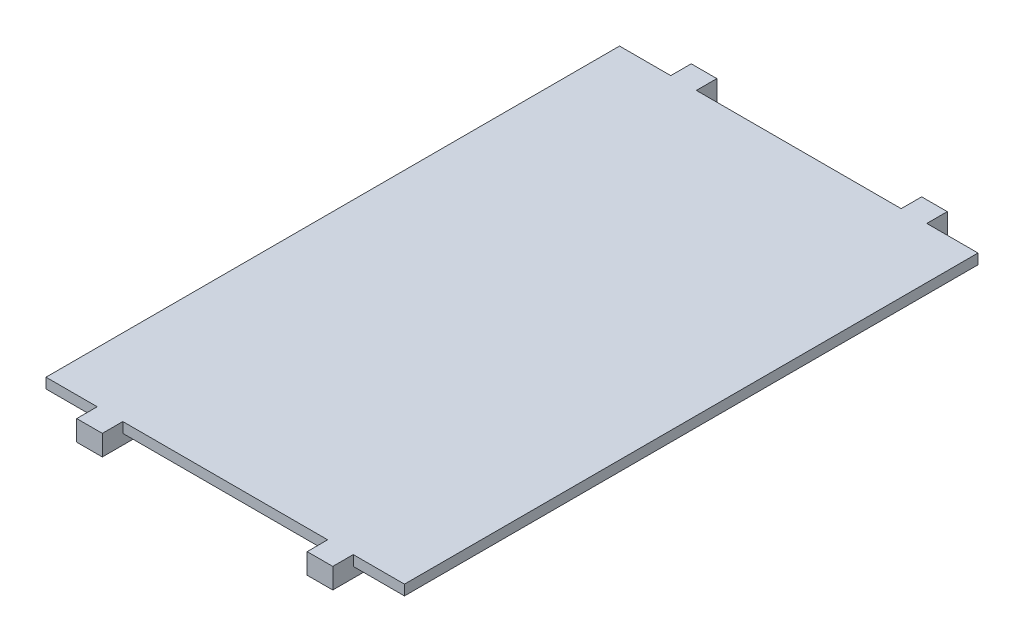
ISO-10303-21;
HEADER;
FILE_DESCRIPTION(('STEP AP214'),'2;1');
FILE_NAME('part.step','',(''),(''),'','','');
FILE_SCHEMA(('AUTOMOTIVE_DESIGN { 1 0 10303 214 1 1 1 1 }'));
ENDSEC;
DATA;
#1=APPLICATION_CONTEXT('core data for automotive mechanical design processes');
#2=APPLICATION_PROTOCOL_DEFINITION('international standard','automotive_design',2000,#1);
#3=PRODUCT_CONTEXT('',#1,'mechanical');
#4=PRODUCT('Part','Part','',(#3));
#5=PRODUCT_RELATED_PRODUCT_CATEGORY('part','',(#4));
#6=PRODUCT_DEFINITION_FORMATION('','',#4);
#7=PRODUCT_DEFINITION_CONTEXT('part definition',#1,'design');
#8=PRODUCT_DEFINITION('design','',#6,#7);
#9=PRODUCT_DEFINITION_SHAPE('','',#8);
#10=(LENGTH_UNIT() NAMED_UNIT(*) SI_UNIT(.MILLI.,.METRE.));
#11=(NAMED_UNIT(*) PLANE_ANGLE_UNIT() SI_UNIT($,.RADIAN.));
#12=(NAMED_UNIT(*) SI_UNIT($,.STERADIAN.) SOLID_ANGLE_UNIT());
#13=UNCERTAINTY_MEASURE_WITH_UNIT(LENGTH_MEASURE(1.E-05),#10,'distance_accuracy_value','');
#14=(GEOMETRIC_REPRESENTATION_CONTEXT(3) GLOBAL_UNCERTAINTY_ASSIGNED_CONTEXT((#13)) GLOBAL_UNIT_ASSIGNED_CONTEXT((#10,
#11,#12)) REPRESENTATION_CONTEXT('',''));
#15=CARTESIAN_POINT('',(0.,0.,0.));
#16=DIRECTION('',(0.,0.,1.));
#17=DIRECTION('',(1.,0.,0.));
#18=AXIS2_PLACEMENT_3D('',#15,#16,#17);
#19=CARTESIAN_POINT('',(0.,0.,0.));
#20=DIRECTION('',(0.,1.,0.));
#21=DIRECTION('',(0.,0.,1.));
#22=AXIS2_PLACEMENT_3D('',#19,#20,#21);
#23=PLANE('',#22);
#24=DIRECTION('',(1.,0.,0.));
#25=VECTOR('',#24,1.);
#26=CARTESIAN_POINT('',(0.,0.,3.));
#27=LINE('',#26,#25);
#28=CARTESIAN_POINT('',(-1.25,0.,3.));
#29=VERTEX_POINT('',#28);
#30=CARTESIAN_POINT('',(-1.,0.,3.));
#31=VERTEX_POINT('',#30);
#32=EDGE_CURVE('E278',#29,#31,#27,.T.);
#33=ORIENTED_EDGE('',*,*,#32,.F.);
#34=DIRECTION('',(0.,0.,1.));
#35=VECTOR('',#34,1.);
#36=CARTESIAN_POINT('',(-1.25,0.,0.));
#37=LINE('',#36,#35);
#38=CARTESIAN_POINT('',(-1.25,0.,2.7));
#39=VERTEX_POINT('',#38);
#40=EDGE_CURVE('E276',#39,#29,#37,.T.);
#41=ORIENTED_EDGE('',*,*,#40,.F.);
#42=DIRECTION('',(1.,0.,0.));
#43=VECTOR('',#42,1.);
#44=CARTESIAN_POINT('',(0.,0.,2.7));
#45=LINE('',#44,#43);
#46=CARTESIAN_POINT('',(-1.65,0.,2.7));
#47=VERTEX_POINT('',#46);
#48=EDGE_CURVE('E274',#47,#39,#45,.T.);
#49=ORIENTED_EDGE('',*,*,#48,.F.);
#50=DIRECTION('',(0.,0.,1.));
#51=VECTOR('',#50,1.);
#52=CARTESIAN_POINT('',(-1.65,0.,-2.7));
#53=LINE('',#52,#51);
#54=CARTESIAN_POINT('',(-1.65,0.,-2.45));
#55=VERTEX_POINT('',#54);
#56=EDGE_CURVE('E299',#55,#47,#53,.T.);
#57=ORIENTED_EDGE('',*,*,#56,.F.);
#58=DIRECTION('',(-0.707106781186548,0.,0.707106781186548));
#59=VECTOR('',#58,1.);
#60=CARTESIAN_POINT('',(-1.525,0.,-2.575));
#61=LINE('',#60,#59);
#62=CARTESIAN_POINT('',(-1.4,0.,-2.7));
#63=VERTEX_POINT('',#62);
#64=EDGE_CURVE('E304',#63,#55,#61,.T.);
#65=ORIENTED_EDGE('',*,*,#64,.F.);
#66=DIRECTION('',(1.,0.,0.));
#67=VECTOR('',#66,1.);
#68=CARTESIAN_POINT('',(0.,0.,-2.7));
#69=LINE('',#68,#67);
#70=CARTESIAN_POINT('',(-1.25,0.,-2.7));
#71=VERTEX_POINT('',#70);
#72=EDGE_CURVE('E272',#71,#63,#69,.F.);
#73=ORIENTED_EDGE('',*,*,#72,.F.);
#74=DIRECTION('',(0.,0.,1.));
#75=VECTOR('',#74,1.);
#76=CARTESIAN_POINT('',(-1.25,0.,0.));
#77=LINE('',#76,#75);
#78=CARTESIAN_POINT('',(-1.25,0.,-3.));
#79=VERTEX_POINT('',#78);
#80=EDGE_CURVE('E270',#79,#71,#77,.T.);
#81=ORIENTED_EDGE('',*,*,#80,.F.);
#82=DIRECTION('',(1.,0.,0.));
#83=VECTOR('',#82,1.);
#84=CARTESIAN_POINT('',(0.,0.,-3.));
#85=LINE('',#84,#83);
#86=CARTESIAN_POINT('',(-1.,0.,-3.));
#87=VERTEX_POINT('',#86);
#88=EDGE_CURVE('E268',#87,#79,#85,.F.);
#89=ORIENTED_EDGE('',*,*,#88,.F.);
#90=DIRECTION('',(0.,0.,1.));
#91=VECTOR('',#90,1.);
#92=CARTESIAN_POINT('',(-1.,0.,0.));
#93=LINE('',#92,#91);
#94=CARTESIAN_POINT('',(-1.,0.,-2.7));
#95=VERTEX_POINT('',#94);
#96=EDGE_CURVE('E266',#95,#87,#93,.F.);
#97=ORIENTED_EDGE('',*,*,#96,.F.);
#98=DIRECTION('',(-1.,0.,0.));
#99=VECTOR('',#98,1.);
#100=CARTESIAN_POINT('',(1.65,0.,-2.7));
#101=LINE('',#100,#99);
#102=CARTESIAN_POINT('',(1.,0.,-2.7));
#103=VERTEX_POINT('',#102);
#104=EDGE_CURVE('E290',#103,#95,#101,.T.);
#105=ORIENTED_EDGE('',*,*,#104,.F.);
#106=DIRECTION('',(0.,0.,1.));
#107=VECTOR('',#106,1.);
#108=CARTESIAN_POINT('',(1.,0.,0.));
#109=LINE('',#108,#107);
#110=CARTESIAN_POINT('',(1.,0.,-3.));
#111=VERTEX_POINT('',#110);
#112=EDGE_CURVE('E264',#111,#103,#109,.T.);
#113=ORIENTED_EDGE('',*,*,#112,.F.);
#114=DIRECTION('',(1.,0.,0.));
#115=VECTOR('',#114,1.);
#116=CARTESIAN_POINT('',(0.,0.,-3.));
#117=LINE('',#116,#115);
#118=CARTESIAN_POINT('',(1.25,0.,-3.));
#119=VERTEX_POINT('',#118);
#120=EDGE_CURVE('E262',#119,#111,#117,.F.);
#121=ORIENTED_EDGE('',*,*,#120,.F.);
#122=DIRECTION('',(0.,0.,1.));
#123=VECTOR('',#122,1.);
#124=CARTESIAN_POINT('',(1.25,0.,0.));
#125=LINE('',#124,#123);
#126=CARTESIAN_POINT('',(1.25,0.,-2.7));
#127=VERTEX_POINT('',#126);
#128=EDGE_CURVE('E260',#127,#119,#125,.F.);
#129=ORIENTED_EDGE('',*,*,#128,.F.);
#130=DIRECTION('',(1.,0.,0.));
#131=VECTOR('',#130,1.);
#132=CARTESIAN_POINT('',(0.,0.,-2.7));
#133=LINE('',#132,#131);
#134=CARTESIAN_POINT('',(1.65,0.,-2.7));
#135=VERTEX_POINT('',#134);
#136=EDGE_CURVE('E258',#135,#127,#133,.F.);
#137=ORIENTED_EDGE('',*,*,#136,.F.);
#138=DIRECTION('',(0.,0.,-1.));
#139=VECTOR('',#138,1.);
#140=CARTESIAN_POINT('',(1.65,0.,2.7));
#141=LINE('',#140,#139);
#142=CARTESIAN_POINT('',(1.65,0.,2.7));
#143=VERTEX_POINT('',#142);
#144=EDGE_CURVE('E285',#143,#135,#141,.T.);
#145=ORIENTED_EDGE('',*,*,#144,.F.);
#146=DIRECTION('',(1.,0.,0.));
#147=VECTOR('',#146,1.);
#148=CARTESIAN_POINT('',(0.,0.,2.7));
#149=LINE('',#148,#147);
#150=CARTESIAN_POINT('',(1.25,0.,2.7));
#151=VERTEX_POINT('',#150);
#152=EDGE_CURVE('E254',#151,#143,#149,.T.);
#153=ORIENTED_EDGE('',*,*,#152,.F.);
#154=DIRECTION('',(0.,0.,1.));
#155=VECTOR('',#154,1.);
#156=CARTESIAN_POINT('',(1.25,0.,0.));
#157=LINE('',#156,#155);
#158=CARTESIAN_POINT('',(1.25,0.,3.));
#159=VERTEX_POINT('',#158);
#160=EDGE_CURVE('E253',#159,#151,#157,.F.);
#161=ORIENTED_EDGE('',*,*,#160,.F.);
#162=DIRECTION('',(1.,0.,0.));
#163=VECTOR('',#162,1.);
#164=CARTESIAN_POINT('',(0.,0.,3.));
#165=LINE('',#164,#163);
#166=CARTESIAN_POINT('',(1.,0.,3.));
#167=VERTEX_POINT('',#166);
#168=EDGE_CURVE('E229',#167,#159,#165,.T.);
#169=ORIENTED_EDGE('',*,*,#168,.F.);
#170=DIRECTION('',(0.,0.,1.));
#171=VECTOR('',#170,1.);
#172=CARTESIAN_POINT('',(1.,0.,0.));
#173=LINE('',#172,#171);
#174=CARTESIAN_POINT('',(1.,0.,2.7));
#175=VERTEX_POINT('',#174);
#176=EDGE_CURVE('E20',#175,#167,#173,.T.);
#177=ORIENTED_EDGE('',*,*,#176,.F.);
#178=DIRECTION('',(1.,0.,0.));
#179=VECTOR('',#178,1.);
#180=CARTESIAN_POINT('',(-1.65,0.,2.7));
#181=LINE('',#180,#179);
#182=CARTESIAN_POINT('',(-1.,0.,2.7));
#183=VERTEX_POINT('',#182);
#184=EDGE_CURVE('E313',#183,#175,#181,.T.);
#185=ORIENTED_EDGE('',*,*,#184,.F.);
#186=DIRECTION('',(0.,0.,1.));
#187=VECTOR('',#186,1.);
#188=CARTESIAN_POINT('',(-1.,0.,0.));
#189=LINE('',#188,#187);
#190=EDGE_CURVE('E280',#31,#183,#189,.F.);
#191=ORIENTED_EDGE('',*,*,#190,.F.);
#192=EDGE_LOOP('',(#33,#41,#49,#57,#65,#73,#81,#89,#97,#105,#113,#121,#129,#137,#145,#153,#161,
#169,#177,#185,#191));
#193=FACE_BOUND('',#192,.T.);
#194=ADVANCED_FACE('F17',(#193),#23,.F.);
#195=CARTESIAN_POINT('',(1.65,0.,2.7));
#196=DIRECTION('',(1.,0.,0.));
#197=DIRECTION('',(0.,0.,-1.));
#198=AXIS2_PLACEMENT_3D('',#195,#196,#197);
#199=PLANE('',#198);
#200=DIRECTION('',(0.,1.,0.));
#201=VECTOR('',#200,1.);
#202=CARTESIAN_POINT('',(1.65,0.,-2.7));
#203=LINE('',#202,#201);
#204=CARTESIAN_POINT('',(1.65,0.1,-2.7));
#205=VERTEX_POINT('',#204);
#206=EDGE_CURVE('E288',#135,#205,#203,.T.);
#207=ORIENTED_EDGE('',*,*,#206,.T.);
#208=DIRECTION('',(0.,0.,1.));
#209=VECTOR('',#208,1.);
#210=CARTESIAN_POINT('',(1.65,0.1,0.));
#211=LINE('',#210,#209);
#212=CARTESIAN_POINT('',(1.65,0.1,2.7));
#213=VERTEX_POINT('',#212);
#214=EDGE_CURVE('E324',#205,#213,#211,.T.);
#215=ORIENTED_EDGE('',*,*,#214,.T.);
#216=DIRECTION('',(0.,1.,0.));
#217=VECTOR('',#216,1.);
#218=CARTESIAN_POINT('',(1.65,0.,2.7));
#219=LINE('',#218,#217);
#220=EDGE_CURVE('E282',#213,#143,#219,.F.);
#221=ORIENTED_EDGE('',*,*,#220,.T.);
#222=ORIENTED_EDGE('',*,*,#144,.T.);
#223=EDGE_LOOP('',(#207,#215,#221,#222));
#224=FACE_BOUND('',#223,.T.);
#225=ADVANCED_FACE('F502',(#224),#199,.T.);
#226=CARTESIAN_POINT('',(1.65,0.,-2.7));
#227=DIRECTION('',(0.,0.,-1.));
#228=DIRECTION('',(-1.,0.,0.));
#229=AXIS2_PLACEMENT_3D('',#226,#227,#228);
#230=PLANE('',#229);
#231=DIRECTION('',(1.,0.,0.));
#232=VECTOR('',#231,1.);
#233=CARTESIAN_POINT('',(0.,0.1,-2.7));
#234=LINE('',#233,#232);
#235=CARTESIAN_POINT('',(-1.,0.1,-2.7));
#236=VERTEX_POINT('',#235);
#237=CARTESIAN_POINT('',(1.,0.1,-2.7));
#238=VERTEX_POINT('',#237);
#239=EDGE_CURVE('E332',#236,#238,#234,.T.);
#240=ORIENTED_EDGE('',*,*,#239,.T.);
#241=DIRECTION('',(0.,1.,0.));
#242=VECTOR('',#241,1.);
#243=CARTESIAN_POINT('',(1.,0.,-2.7));
#244=LINE('',#243,#242);
#245=EDGE_CURVE('E296',#238,#103,#244,.F.);
#246=ORIENTED_EDGE('',*,*,#245,.T.);
#247=ORIENTED_EDGE('',*,*,#104,.T.);
#248=DIRECTION('',(0.,1.,0.));
#249=VECTOR('',#248,1.);
#250=CARTESIAN_POINT('',(-1.,0.,-2.7));
#251=LINE('',#250,#249);
#252=EDGE_CURVE('E293',#95,#236,#251,.T.);
#253=ORIENTED_EDGE('',*,*,#252,.T.);
#254=EDGE_LOOP('',(#240,#246,#247,#253));
#255=FACE_BOUND('',#254,.T.);
#256=ADVANCED_FACE('F850',(#255),#230,.T.);
#257=CARTESIAN_POINT('',(-1.65,0.,-2.7));
#258=DIRECTION('',(-1.,0.,0.));
#259=DIRECTION('',(0.,0.,1.));
#260=AXIS2_PLACEMENT_3D('',#257,#258,#259);
#261=PLANE('',#260);
#262=DIRECTION('',(0.,1.,0.));
#263=VECTOR('',#262,1.);
#264=CARTESIAN_POINT('',(-1.65,0.,2.7));
#265=LINE('',#264,#263);
#266=CARTESIAN_POINT('',(-1.65,0.1,2.7));
#267=VERTEX_POINT('',#266);
#268=EDGE_CURVE('E302',#47,#267,#265,.T.);
#269=ORIENTED_EDGE('',*,*,#268,.T.);
#270=DIRECTION('',(0.,0.,1.));
#271=VECTOR('',#270,1.);
#272=CARTESIAN_POINT('',(-1.65,0.1,0.));
#273=LINE('',#272,#271);
#274=CARTESIAN_POINT('',(-1.65,0.1,-2.45));
#275=VERTEX_POINT('',#274);
#276=EDGE_CURVE('E340',#267,#275,#273,.F.);
#277=ORIENTED_EDGE('',*,*,#276,.T.);
#278=DIRECTION('',(0.,1.,0.));
#279=VECTOR('',#278,1.);
#280=CARTESIAN_POINT('',(-1.65,0.1,-2.45));
#281=LINE('',#280,#279);
#282=EDGE_CURVE('E307',#55,#275,#281,.T.);
#283=ORIENTED_EDGE('',*,*,#282,.F.);
#284=ORIENTED_EDGE('',*,*,#56,.T.);
#285=EDGE_LOOP('',(#269,#277,#283,#284));
#286=FACE_BOUND('',#285,.T.);
#287=ADVANCED_FACE('F841',(#286),#261,.T.);
#288=CARTESIAN_POINT('',(-1.525,0.1,-2.575));
#289=DIRECTION('',(-0.707106781186548,0.,-0.707106781186548));
#290=DIRECTION('',(-0.707106781186548,0.,0.707106781186548));
#291=AXIS2_PLACEMENT_3D('',#288,#289,#290);
#292=PLANE('',#291);
#293=ORIENTED_EDGE('',*,*,#282,.T.);
#294=DIRECTION('',(0.707106781186548,0.,-0.707106781186547));
#295=VECTOR('',#294,1.);
#296=CARTESIAN_POINT('',(-1.65,0.1,-2.45));
#297=LINE('',#296,#295);
#298=CARTESIAN_POINT('',(-1.4,0.1,-2.7));
#299=VERTEX_POINT('',#298);
#300=EDGE_CURVE('E342',#275,#299,#297,.T.);
#301=ORIENTED_EDGE('',*,*,#300,.T.);
#302=DIRECTION('',(0.,1.,0.));
#303=VECTOR('',#302,1.);
#304=CARTESIAN_POINT('',(-1.4,0.,-2.7));
#305=LINE('',#304,#303);
#306=EDGE_CURVE('E335',#63,#299,#305,.T.);
#307=ORIENTED_EDGE('',*,*,#306,.F.);
#308=ORIENTED_EDGE('',*,*,#64,.T.);
#309=EDGE_LOOP('',(#293,#301,#307,#308));
#310=FACE_BOUND('',#309,.T.);
#311=ADVANCED_FACE('F833',(#310),#292,.T.);
#312=CARTESIAN_POINT('',(-1.65,0.,2.7));
#313=DIRECTION('',(0.,0.,1.));
#314=DIRECTION('',(1.,0.,0.));
#315=AXIS2_PLACEMENT_3D('',#312,#313,#314);
#316=PLANE('',#315);
#317=ORIENTED_EDGE('',*,*,#184,.T.);
#318=DIRECTION('',(0.,1.,0.));
#319=VECTOR('',#318,1.);
#320=CARTESIAN_POINT('',(1.,0.,2.7));
#321=LINE('',#320,#319);
#322=CARTESIAN_POINT('',(1.,0.1,2.7));
#323=VERTEX_POINT('',#322);
#324=EDGE_CURVE('E239',#175,#323,#321,.T.);
#325=ORIENTED_EDGE('',*,*,#324,.T.);
#326=DIRECTION('',(1.,0.,0.));
#327=VECTOR('',#326,1.);
#328=CARTESIAN_POINT('',(0.,0.1,2.7));
#329=LINE('',#328,#327);
#330=CARTESIAN_POINT('',(-1.,0.1,2.7));
#331=VERTEX_POINT('',#330);
#332=EDGE_CURVE('E353',#323,#331,#329,.F.);
#333=ORIENTED_EDGE('',*,*,#332,.T.);
#334=DIRECTION('',(0.,1.,0.));
#335=VECTOR('',#334,1.);
#336=CARTESIAN_POINT('',(-1.,0.,2.7));
#337=LINE('',#336,#335);
#338=EDGE_CURVE('E310',#331,#183,#337,.F.);
#339=ORIENTED_EDGE('',*,*,#338,.T.);
#340=EDGE_LOOP('',(#317,#325,#333,#339));
#341=FACE_BOUND('',#340,.T.);
#342=ADVANCED_FACE('F581',(#341),#316,.T.);
#343=CARTESIAN_POINT('',(0.,0.1,0.));
#344=DIRECTION('',(0.,1.,0.));
#345=DIRECTION('',(0.,0.,1.));
#346=AXIS2_PLACEMENT_3D('',#343,#344,#345);
#347=PLANE('',#346);
#348=ORIENTED_EDGE('',*,*,#214,.F.);
#349=DIRECTION('',(-1.,0.,0.));
#350=VECTOR('',#349,1.);
#351=CARTESIAN_POINT('',(1.65,0.1,-2.7));
#352=LINE('',#351,#350);
#353=CARTESIAN_POINT('',(1.25,0.1,-2.7));
#354=VERTEX_POINT('',#353);
#355=EDGE_CURVE('E327',#354,#205,#352,.F.);
#356=ORIENTED_EDGE('',*,*,#355,.F.);
#357=DIRECTION('',(0.,0.,1.));
#358=VECTOR('',#357,1.);
#359=CARTESIAN_POINT('',(1.25,0.1,0.));
#360=LINE('',#359,#358);
#361=CARTESIAN_POINT('',(1.25,0.1,-2.8));
#362=VERTEX_POINT('',#361);
#363=EDGE_CURVE('E322',#362,#354,#360,.T.);
#364=ORIENTED_EDGE('',*,*,#363,.F.);
#365=DIRECTION('',(1.,0.,0.));
#366=VECTOR('',#365,1.);
#367=CARTESIAN_POINT('',(0.,0.1,-2.8));
#368=LINE('',#367,#366);
#369=CARTESIAN_POINT('',(1.75,0.1,-2.8));
#370=VERTEX_POINT('',#369);
#371=EDGE_CURVE('E320',#370,#362,#368,.F.);
#372=ORIENTED_EDGE('',*,*,#371,.F.);
#373=DIRECTION('',(0.,0.,-1.));
#374=VECTOR('',#373,1.);
#375=CARTESIAN_POINT('',(1.75,0.1,2.8));
#376=LINE('',#375,#374);
#377=CARTESIAN_POINT('',(1.75,0.1,2.8));
#378=VERTEX_POINT('',#377);
#379=EDGE_CURVE('E359',#378,#370,#376,.T.);
#380=ORIENTED_EDGE('',*,*,#379,.F.);
#381=DIRECTION('',(1.,0.,0.));
#382=VECTOR('',#381,1.);
#383=CARTESIAN_POINT('',(0.,0.1,2.8));
#384=LINE('',#383,#382);
#385=CARTESIAN_POINT('',(1.25,0.1,2.8));
#386=VERTEX_POINT('',#385);
#387=EDGE_CURVE('E318',#386,#378,#384,.T.);
#388=ORIENTED_EDGE('',*,*,#387,.F.);
#389=DIRECTION('',(0.,0.,1.));
#390=VECTOR('',#389,1.);
#391=CARTESIAN_POINT('',(1.25,0.1,0.));
#392=LINE('',#391,#390);
#393=CARTESIAN_POINT('',(1.25,0.1,2.7));
#394=VERTEX_POINT('',#393);
#395=EDGE_CURVE('E316',#394,#386,#392,.T.);
#396=ORIENTED_EDGE('',*,*,#395,.F.);
#397=DIRECTION('',(1.,0.,0.));
#398=VECTOR('',#397,1.);
#399=CARTESIAN_POINT('',(-1.65,0.1,2.7));
#400=LINE('',#399,#398);
#401=EDGE_CURVE('E356',#213,#394,#400,.F.);
#402=ORIENTED_EDGE('',*,*,#401,.F.);
#403=EDGE_LOOP('',(#348,#356,#364,#372,#380,#388,#396,#402));
#404=FACE_BOUND('',#403,.T.);
#405=ADVANCED_FACE('F506',(#404),#347,.F.);
#406=CARTESIAN_POINT('',(1.65,0.,-2.7));
#407=DIRECTION('',(0.,0.,-1.));
#408=DIRECTION('',(-1.,0.,0.));
#409=AXIS2_PLACEMENT_3D('',#406,#407,#408);
#410=PLANE('',#409);
#411=ORIENTED_EDGE('',*,*,#136,.T.);
#412=DIRECTION('',(0.,1.,0.));
#413=VECTOR('',#412,1.);
#414=CARTESIAN_POINT('',(1.25,0.,-2.7));
#415=LINE('',#414,#413);
#416=EDGE_CURVE('E365',#127,#354,#415,.T.);
#417=ORIENTED_EDGE('',*,*,#416,.T.);
#418=ORIENTED_EDGE('',*,*,#355,.T.);
#419=ORIENTED_EDGE('',*,*,#206,.F.);
#420=EDGE_LOOP('',(#411,#417,#418,#419));
#421=FACE_BOUND('',#420,.T.);
#422=ADVANCED_FACE('F809',(#421),#410,.T.);
#423=CARTESIAN_POINT('',(0.,0.1,0.));
#424=DIRECTION('',(0.,1.,0.));
#425=DIRECTION('',(0.,0.,1.));
#426=AXIS2_PLACEMENT_3D('',#423,#424,#425);
#427=PLANE('',#426);
#428=DIRECTION('',(0.,0.,1.));
#429=VECTOR('',#428,1.);
#430=CARTESIAN_POINT('',(-1.,0.1,0.));
#431=LINE('',#430,#429);
#432=CARTESIAN_POINT('',(-1.,0.1,-2.8));
#433=VERTEX_POINT('',#432);
#434=EDGE_CURVE('E330',#433,#236,#431,.T.);
#435=ORIENTED_EDGE('',*,*,#434,.F.);
#436=DIRECTION('',(-1.,0.,0.));
#437=VECTOR('',#436,1.);
#438=CARTESIAN_POINT('',(1.75,0.1,-2.8));
#439=LINE('',#438,#437);
#440=CARTESIAN_POINT('',(1.,0.1,-2.8));
#441=VERTEX_POINT('',#440);
#442=EDGE_CURVE('E377',#441,#433,#439,.T.);
#443=ORIENTED_EDGE('',*,*,#442,.F.);
#444=DIRECTION('',(0.,0.,-1.));
#445=VECTOR('',#444,1.);
#446=CARTESIAN_POINT('',(1.,0.1,-2.7));
#447=LINE('',#446,#445);
#448=EDGE_CURVE('E374',#441,#238,#447,.F.);
#449=ORIENTED_EDGE('',*,*,#448,.T.);
#450=ORIENTED_EDGE('',*,*,#239,.F.);
#451=EDGE_LOOP('',(#435,#443,#449,#450));
#452=FACE_BOUND('',#451,.T.);
#453=ADVANCED_FACE('F800',(#452),#427,.F.);
#454=CARTESIAN_POINT('',(1.65,0.,-2.7));
#455=DIRECTION('',(0.,0.,-1.));
#456=DIRECTION('',(-1.,0.,0.));
#457=AXIS2_PLACEMENT_3D('',#454,#455,#456);
#458=PLANE('',#457);
#459=DIRECTION('',(1.,0.,0.));
#460=VECTOR('',#459,1.);
#461=CARTESIAN_POINT('',(0.,0.1,-2.7));
#462=LINE('',#461,#460);
#463=CARTESIAN_POINT('',(-1.25,0.1,-2.7));
#464=VERTEX_POINT('',#463);
#465=EDGE_CURVE('E344',#299,#464,#462,.T.);
#466=ORIENTED_EDGE('',*,*,#465,.T.);
#467=DIRECTION('',(0.,1.,0.));
#468=VECTOR('',#467,1.);
#469=CARTESIAN_POINT('',(-1.25,0.,-2.7));
#470=LINE('',#469,#468);
#471=EDGE_CURVE('E394',#71,#464,#470,.T.);
#472=ORIENTED_EDGE('',*,*,#471,.F.);
#473=ORIENTED_EDGE('',*,*,#72,.T.);
#474=ORIENTED_EDGE('',*,*,#306,.T.);
#475=EDGE_LOOP('',(#466,#472,#473,#474));
#476=FACE_BOUND('',#475,.T.);
#477=ADVANCED_FACE('F791',(#476),#458,.T.);
#478=CARTESIAN_POINT('',(0.,0.1,0.));
#479=DIRECTION('',(0.,1.,0.));
#480=DIRECTION('',(0.,0.,1.));
#481=AXIS2_PLACEMENT_3D('',#478,#479,#480);
#482=PLANE('',#481);
#483=DIRECTION('',(0.,0.,1.));
#484=VECTOR('',#483,1.);
#485=CARTESIAN_POINT('',(-1.75,0.1,-2.8));
#486=LINE('',#485,#484);
#487=CARTESIAN_POINT('',(-1.75,0.1,-2.8));
#488=VERTEX_POINT('',#487);
#489=CARTESIAN_POINT('',(-1.75,0.1,2.8));
#490=VERTEX_POINT('',#489);
#491=EDGE_CURVE('E405',#488,#490,#486,.T.);
#492=ORIENTED_EDGE('',*,*,#491,.F.);
#493=DIRECTION('',(-1.,0.,0.));
#494=VECTOR('',#493,1.);
#495=CARTESIAN_POINT('',(1.75,0.1,-2.8));
#496=LINE('',#495,#494);
#497=CARTESIAN_POINT('',(-1.25,0.1,-2.8));
#498=VERTEX_POINT('',#497);
#499=EDGE_CURVE('E400',#498,#488,#496,.T.);
#500=ORIENTED_EDGE('',*,*,#499,.F.);
#501=DIRECTION('',(0.,0.,1.));
#502=VECTOR('',#501,1.);
#503=CARTESIAN_POINT('',(-1.25,0.1,-3.));
#504=LINE('',#503,#502);
#505=EDGE_CURVE('E389',#464,#498,#504,.F.);
#506=ORIENTED_EDGE('',*,*,#505,.F.);
#507=ORIENTED_EDGE('',*,*,#465,.F.);
#508=ORIENTED_EDGE('',*,*,#300,.F.);
#509=ORIENTED_EDGE('',*,*,#276,.F.);
#510=DIRECTION('',(1.,0.,0.));
#511=VECTOR('',#510,1.);
#512=CARTESIAN_POINT('',(-1.65,0.1,2.7));
#513=LINE('',#512,#511);
#514=CARTESIAN_POINT('',(-1.25,0.1,2.7));
#515=VERTEX_POINT('',#514);
#516=EDGE_CURVE('E348',#515,#267,#513,.F.);
#517=ORIENTED_EDGE('',*,*,#516,.F.);
#518=DIRECTION('',(0.,0.,1.));
#519=VECTOR('',#518,1.);
#520=CARTESIAN_POINT('',(-1.25,0.1,0.));
#521=LINE('',#520,#519);
#522=CARTESIAN_POINT('',(-1.25,0.1,2.8));
#523=VERTEX_POINT('',#522);
#524=EDGE_CURVE('E338',#523,#515,#521,.F.);
#525=ORIENTED_EDGE('',*,*,#524,.F.);
#526=DIRECTION('',(1.,0.,0.));
#527=VECTOR('',#526,1.);
#528=CARTESIAN_POINT('',(0.,0.1,2.8));
#529=LINE('',#528,#527);
#530=EDGE_CURVE('E346',#490,#523,#529,.T.);
#531=ORIENTED_EDGE('',*,*,#530,.F.);
#532=EDGE_LOOP('',(#492,#500,#506,#507,#508,#509,#517,#525,#531));
#533=FACE_BOUND('',#532,.T.);
#534=ADVANCED_FACE('F592',(#533),#482,.F.);
#535=CARTESIAN_POINT('',(-1.65,0.,2.7));
#536=DIRECTION('',(0.,0.,1.));
#537=DIRECTION('',(1.,0.,0.));
#538=AXIS2_PLACEMENT_3D('',#535,#536,#537);
#539=PLANE('',#538);
#540=ORIENTED_EDGE('',*,*,#48,.T.);
#541=DIRECTION('',(0.,1.,0.));
#542=VECTOR('',#541,1.);
#543=CARTESIAN_POINT('',(-1.25,0.,2.7));
#544=LINE('',#543,#542);
#545=EDGE_CURVE('E411',#39,#515,#544,.T.);
#546=ORIENTED_EDGE('',*,*,#545,.T.);
#547=ORIENTED_EDGE('',*,*,#516,.T.);
#548=ORIENTED_EDGE('',*,*,#268,.F.);
#549=EDGE_LOOP('',(#540,#546,#547,#548));
#550=FACE_BOUND('',#549,.T.);
#551=ADVANCED_FACE('F584',(#550),#539,.T.);
#552=CARTESIAN_POINT('',(0.,0.1,0.));
#553=DIRECTION('',(0.,1.,0.));
#554=DIRECTION('',(0.,0.,1.));
#555=AXIS2_PLACEMENT_3D('',#552,#553,#554);
#556=PLANE('',#555);
#557=DIRECTION('',(0.,0.,1.));
#558=VECTOR('',#557,1.);
#559=CARTESIAN_POINT('',(-1.,0.1,2.7));
#560=LINE('',#559,#558);
#561=CARTESIAN_POINT('',(-1.,0.1,2.8));
#562=VERTEX_POINT('',#561);
#563=EDGE_CURVE('E420',#562,#331,#560,.F.);
#564=ORIENTED_EDGE('',*,*,#563,.T.);
#565=ORIENTED_EDGE('',*,*,#332,.F.);
#566=DIRECTION('',(0.,0.,1.));
#567=VECTOR('',#566,1.);
#568=CARTESIAN_POINT('',(1.,0.1,0.));
#569=LINE('',#568,#567);
#570=CARTESIAN_POINT('',(1.,0.1,2.8));
#571=VERTEX_POINT('',#570);
#572=EDGE_CURVE('E351',#571,#323,#569,.F.);
#573=ORIENTED_EDGE('',*,*,#572,.F.);
#574=DIRECTION('',(1.,0.,0.));
#575=VECTOR('',#574,1.);
#576=CARTESIAN_POINT('',(-1.75,0.1,2.8));
#577=LINE('',#576,#575);
#578=EDGE_CURVE('E426',#562,#571,#577,.T.);
#579=ORIENTED_EDGE('',*,*,#578,.F.);
#580=EDGE_LOOP('',(#564,#565,#573,#579));
#581=FACE_BOUND('',#580,.T.);
#582=ADVANCED_FACE('F582',(#581),#556,.F.);
#583=CARTESIAN_POINT('',(-1.65,0.,2.7));
#584=DIRECTION('',(0.,0.,1.));
#585=DIRECTION('',(1.,0.,0.));
#586=AXIS2_PLACEMENT_3D('',#583,#584,#585);
#587=PLANE('',#586);
#588=ORIENTED_EDGE('',*,*,#401,.T.);
#589=DIRECTION('',(0.,1.,0.));
#590=VECTOR('',#589,1.);
#591=CARTESIAN_POINT('',(1.25,0.,2.7));
#592=LINE('',#591,#590);
#593=EDGE_CURVE('E247',#151,#394,#592,.T.);
#594=ORIENTED_EDGE('',*,*,#593,.F.);
#595=ORIENTED_EDGE('',*,*,#152,.T.);
#596=ORIENTED_EDGE('',*,*,#220,.F.);
#597=EDGE_LOOP('',(#588,#594,#595,#596));
#598=FACE_BOUND('',#597,.T.);
#599=ADVANCED_FACE('F496',(#598),#587,.T.);
#600=CARTESIAN_POINT('',(1.75,0.1,2.8));
#601=DIRECTION('',(1.,0.,0.));
#602=DIRECTION('',(0.,0.,-1.));
#603=AXIS2_PLACEMENT_3D('',#600,#601,#602);
#604=PLANE('',#603);
#605=DIRECTION('',(0.,1.,0.));
#606=VECTOR('',#605,1.);
#607=CARTESIAN_POINT('',(1.75,0.1,2.8));
#608=LINE('',#607,#606);
#609=CARTESIAN_POINT('',(1.75,0.2,2.8));
#610=VERTEX_POINT('',#609);
#611=EDGE_CURVE('E435',#378,#610,#608,.T.);
#612=ORIENTED_EDGE('',*,*,#611,.F.);
#613=ORIENTED_EDGE('',*,*,#379,.T.);
#614=DIRECTION('',(0.,1.,0.));
#615=VECTOR('',#614,1.);
#616=CARTESIAN_POINT('',(1.75,0.1,-2.8));
#617=LINE('',#616,#615);
#618=CARTESIAN_POINT('',(1.75,0.2,-2.8));
#619=VERTEX_POINT('',#618);
#620=EDGE_CURVE('E362',#619,#370,#617,.F.);
#621=ORIENTED_EDGE('',*,*,#620,.F.);
#622=DIRECTION('',(0.,0.,1.));
#623=VECTOR('',#622,1.);
#624=CARTESIAN_POINT('',(1.75,0.2,0.));
#625=LINE('',#624,#623);
#626=EDGE_CURVE('E439',#610,#619,#625,.F.);
#627=ORIENTED_EDGE('',*,*,#626,.F.);
#628=EDGE_LOOP('',(#612,#613,#621,#627));
#629=FACE_BOUND('',#628,.T.);
#630=ADVANCED_FACE('F513',(#629),#604,.T.);
#631=CARTESIAN_POINT('',(1.75,0.1,-2.8));
#632=DIRECTION('',(0.,0.,-1.));
#633=DIRECTION('',(-1.,0.,0.));
#634=AXIS2_PLACEMENT_3D('',#631,#632,#633);
#635=PLANE('',#634);
#636=ORIENTED_EDGE('',*,*,#371,.T.);
#637=DIRECTION('',(0.,1.,0.));
#638=VECTOR('',#637,1.);
#639=CARTESIAN_POINT('',(1.25,0.,-2.8));
#640=LINE('',#639,#638);
#641=CARTESIAN_POINT('',(1.25,0.2,-2.8));
#642=VERTEX_POINT('',#641);
#643=EDGE_CURVE('E368',#362,#642,#640,.T.);
#644=ORIENTED_EDGE('',*,*,#643,.T.);
#645=DIRECTION('',(1.,0.,0.));
#646=VECTOR('',#645,1.);
#647=CARTESIAN_POINT('',(0.,0.2,-2.8));
#648=LINE('',#647,#646);
#649=EDGE_CURVE('E442',#619,#642,#648,.F.);
#650=ORIENTED_EDGE('',*,*,#649,.F.);
#651=ORIENTED_EDGE('',*,*,#620,.T.);
#652=EDGE_LOOP('',(#636,#644,#650,#651));
#653=FACE_BOUND('',#652,.T.);
#654=ADVANCED_FACE('F517',(#653),#635,.T.);
#655=CARTESIAN_POINT('',(1.25,0.,-3.));
#656=DIRECTION('',(-1.,0.,0.));
#657=DIRECTION('',(0.,0.,1.));
#658=AXIS2_PLACEMENT_3D('',#655,#656,#657);
#659=PLANE('',#658);
#660=DIRECTION('',(0.,0.,1.));
#661=VECTOR('',#660,1.);
#662=CARTESIAN_POINT('',(1.25,0.2,0.));
#663=LINE('',#662,#661);
#664=CARTESIAN_POINT('',(1.25,0.2,-3.));
#665=VERTEX_POINT('',#664);
#666=EDGE_CURVE('E445',#642,#665,#663,.F.);
#667=ORIENTED_EDGE('',*,*,#666,.F.);
#668=ORIENTED_EDGE('',*,*,#643,.F.);
#669=ORIENTED_EDGE('',*,*,#363,.T.);
#670=ORIENTED_EDGE('',*,*,#416,.F.);
#671=ORIENTED_EDGE('',*,*,#128,.T.);
#672=DIRECTION('',(0.,1.,0.));
#673=VECTOR('',#672,1.);
#674=CARTESIAN_POINT('',(1.25,0.,-3.));
#675=LINE('',#674,#673);
#676=EDGE_CURVE('E370',#119,#665,#675,.T.);
#677=ORIENTED_EDGE('',*,*,#676,.T.);
#678=EDGE_LOOP('',(#667,#668,#669,#670,#671,#677));
#679=FACE_BOUND('',#678,.T.);
#680=ADVANCED_FACE('F521',(#679),#659,.F.);
#681=CARTESIAN_POINT('',(1.,0.,-3.));
#682=DIRECTION('',(0.,0.,1.));
#683=DIRECTION('',(1.,0.,0.));
#684=AXIS2_PLACEMENT_3D('',#681,#682,#683);
#685=PLANE('',#684);
#686=DIRECTION('',(1.,0.,0.));
#687=VECTOR('',#686,1.);
#688=CARTESIAN_POINT('',(0.,0.2,-3.));
#689=LINE('',#688,#687);
#690=CARTESIAN_POINT('',(1.,0.2,-3.));
#691=VERTEX_POINT('',#690);
#692=EDGE_CURVE('E448',#665,#691,#689,.F.);
#693=ORIENTED_EDGE('',*,*,#692,.F.);
#694=ORIENTED_EDGE('',*,*,#676,.F.);
#695=ORIENTED_EDGE('',*,*,#120,.T.);
#696=DIRECTION('',(0.,1.,0.));
#697=VECTOR('',#696,1.);
#698=CARTESIAN_POINT('',(1.,0.,-3.));
#699=LINE('',#698,#697);
#700=EDGE_CURVE('E372',#111,#691,#699,.T.);
#701=ORIENTED_EDGE('',*,*,#700,.T.);
#702=EDGE_LOOP('',(#693,#694,#695,#701));
#703=FACE_BOUND('',#702,.T.);
#704=ADVANCED_FACE('F527',(#703),#685,.F.);
#705=CARTESIAN_POINT('',(1.,0.,-2.7));
#706=DIRECTION('',(1.,0.,0.));
#707=DIRECTION('',(0.,0.,-1.));
#708=AXIS2_PLACEMENT_3D('',#705,#706,#707);
#709=PLANE('',#708);
#710=ORIENTED_EDGE('',*,*,#448,.F.);
#711=DIRECTION('',(0.,1.,0.));
#712=VECTOR('',#711,1.);
#713=CARTESIAN_POINT('',(1.,0.1,-2.8));
#714=LINE('',#713,#712);
#715=CARTESIAN_POINT('',(1.,0.2,-2.8));
#716=VERTEX_POINT('',#715);
#717=EDGE_CURVE('E380',#716,#441,#714,.F.);
#718=ORIENTED_EDGE('',*,*,#717,.F.);
#719=DIRECTION('',(0.,0.,1.));
#720=VECTOR('',#719,1.);
#721=CARTESIAN_POINT('',(1.,0.2,0.));
#722=LINE('',#721,#720);
#723=EDGE_CURVE('E451',#691,#716,#722,.T.);
#724=ORIENTED_EDGE('',*,*,#723,.F.);
#725=ORIENTED_EDGE('',*,*,#700,.F.);
#726=ORIENTED_EDGE('',*,*,#112,.T.);
#727=ORIENTED_EDGE('',*,*,#245,.F.);
#728=EDGE_LOOP('',(#710,#718,#724,#725,#726,#727));
#729=FACE_BOUND('',#728,.T.);
#730=ADVANCED_FACE('F533',(#729),#709,.F.);
#731=CARTESIAN_POINT('',(1.75,0.1,-2.8));
#732=DIRECTION('',(0.,0.,-1.));
#733=DIRECTION('',(-1.,0.,0.));
#734=AXIS2_PLACEMENT_3D('',#731,#732,#733);
#735=PLANE('',#734);
#736=DIRECTION('',(1.,0.,0.));
#737=VECTOR('',#736,1.);
#738=CARTESIAN_POINT('',(0.,0.2,-2.8));
#739=LINE('',#738,#737);
#740=CARTESIAN_POINT('',(-1.,0.2,-2.8));
#741=VERTEX_POINT('',#740);
#742=EDGE_CURVE('E454',#716,#741,#739,.F.);
#743=ORIENTED_EDGE('',*,*,#742,.F.);
#744=ORIENTED_EDGE('',*,*,#717,.T.);
#745=ORIENTED_EDGE('',*,*,#442,.T.);
#746=DIRECTION('',(0.,1.,0.));
#747=VECTOR('',#746,1.);
#748=CARTESIAN_POINT('',(-1.,0.,-2.8));
#749=LINE('',#748,#747);
#750=EDGE_CURVE('E383',#741,#433,#749,.F.);
#751=ORIENTED_EDGE('',*,*,#750,.F.);
#752=EDGE_LOOP('',(#743,#744,#745,#751));
#753=FACE_BOUND('',#752,.T.);
#754=ADVANCED_FACE('F536',(#753),#735,.T.);
#755=CARTESIAN_POINT('',(-1.,0.,-2.7));
#756=DIRECTION('',(1.,0.,0.));
#757=DIRECTION('',(0.,0.,-1.));
#758=AXIS2_PLACEMENT_3D('',#755,#756,#757);
#759=PLANE('',#758);
#760=ORIENTED_EDGE('',*,*,#434,.T.);
#761=ORIENTED_EDGE('',*,*,#252,.F.);
#762=ORIENTED_EDGE('',*,*,#96,.T.);
#763=DIRECTION('',(0.,1.,0.));
#764=VECTOR('',#763,1.);
#765=CARTESIAN_POINT('',(-1.,0.,-3.));
#766=LINE('',#765,#764);
#767=CARTESIAN_POINT('',(-1.,0.2,-3.));
#768=VERTEX_POINT('',#767);
#769=EDGE_CURVE('E386',#768,#87,#766,.F.);
#770=ORIENTED_EDGE('',*,*,#769,.F.);
#771=DIRECTION('',(0.,0.,1.));
#772=VECTOR('',#771,1.);
#773=CARTESIAN_POINT('',(-1.,0.2,0.));
#774=LINE('',#773,#772);
#775=EDGE_CURVE('E457',#741,#768,#774,.F.);
#776=ORIENTED_EDGE('',*,*,#775,.F.);
#777=ORIENTED_EDGE('',*,*,#750,.T.);
#778=EDGE_LOOP('',(#760,#761,#762,#770,#776,#777));
#779=FACE_BOUND('',#778,.T.);
#780=ADVANCED_FACE('F539',(#779),#759,.T.);
#781=CARTESIAN_POINT('',(-1.,0.,-3.));
#782=DIRECTION('',(0.,0.,-1.));
#783=DIRECTION('',(-1.,0.,0.));
#784=AXIS2_PLACEMENT_3D('',#781,#782,#783);
#785=PLANE('',#784);
#786=ORIENTED_EDGE('',*,*,#769,.T.);
#787=ORIENTED_EDGE('',*,*,#88,.T.);
#788=DIRECTION('',(0.,1.,0.));
#789=VECTOR('',#788,1.);
#790=CARTESIAN_POINT('',(-1.25,0.,-3.));
#791=LINE('',#790,#789);
#792=CARTESIAN_POINT('',(-1.25,0.2,-3.));
#793=VERTEX_POINT('',#792);
#794=EDGE_CURVE('E391',#793,#79,#791,.F.);
#795=ORIENTED_EDGE('',*,*,#794,.F.);
#796=DIRECTION('',(1.,0.,0.));
#797=VECTOR('',#796,1.);
#798=CARTESIAN_POINT('',(0.,0.2,-3.));
#799=LINE('',#798,#797);
#800=EDGE_CURVE('E460',#768,#793,#799,.F.);
#801=ORIENTED_EDGE('',*,*,#800,.F.);
#802=EDGE_LOOP('',(#786,#787,#795,#801));
#803=FACE_BOUND('',#802,.T.);
#804=ADVANCED_FACE('F543',(#803),#785,.T.);
#805=CARTESIAN_POINT('',(-1.25,0.,-3.));
#806=DIRECTION('',(-1.,0.,0.));
#807=DIRECTION('',(0.,0.,1.));
#808=AXIS2_PLACEMENT_3D('',#805,#806,#807);
#809=PLANE('',#808);
#810=ORIENTED_EDGE('',*,*,#80,.T.);
#811=ORIENTED_EDGE('',*,*,#471,.T.);
#812=ORIENTED_EDGE('',*,*,#505,.T.);
#813=DIRECTION('',(0.,1.,0.));
#814=VECTOR('',#813,1.);
#815=CARTESIAN_POINT('',(-1.25,0.1,-2.8));
#816=LINE('',#815,#814);
#817=CARTESIAN_POINT('',(-1.25,0.2,-2.8));
#818=VERTEX_POINT('',#817);
#819=EDGE_CURVE('E397',#818,#498,#816,.F.);
#820=ORIENTED_EDGE('',*,*,#819,.F.);
#821=DIRECTION('',(0.,0.,1.));
#822=VECTOR('',#821,1.);
#823=CARTESIAN_POINT('',(-1.25,0.2,0.));
#824=LINE('',#823,#822);
#825=EDGE_CURVE('E463',#793,#818,#824,.T.);
#826=ORIENTED_EDGE('',*,*,#825,.F.);
#827=ORIENTED_EDGE('',*,*,#794,.T.);
#828=EDGE_LOOP('',(#810,#811,#812,#820,#826,#827));
#829=FACE_BOUND('',#828,.T.);
#830=ADVANCED_FACE('F547',(#829),#809,.T.);
#831=CARTESIAN_POINT('',(1.75,0.1,-2.8));
#832=DIRECTION('',(0.,0.,-1.));
#833=DIRECTION('',(-1.,0.,0.));
#834=AXIS2_PLACEMENT_3D('',#831,#832,#833);
#835=PLANE('',#834);
#836=ORIENTED_EDGE('',*,*,#819,.T.);
#837=ORIENTED_EDGE('',*,*,#499,.T.);
#838=DIRECTION('',(0.,1.,0.));
#839=VECTOR('',#838,1.);
#840=CARTESIAN_POINT('',(-1.75,0.1,-2.8));
#841=LINE('',#840,#839);
#842=CARTESIAN_POINT('',(-1.75,0.2,-2.8));
#843=VERTEX_POINT('',#842);
#844=EDGE_CURVE('E402',#843,#488,#841,.F.);
#845=ORIENTED_EDGE('',*,*,#844,.F.);
#846=DIRECTION('',(1.,0.,0.));
#847=VECTOR('',#846,1.);
#848=CARTESIAN_POINT('',(0.,0.2,-2.8));
#849=LINE('',#848,#847);
#850=EDGE_CURVE('E466',#818,#843,#849,.F.);
#851=ORIENTED_EDGE('',*,*,#850,.F.);
#852=EDGE_LOOP('',(#836,#837,#845,#851));
#853=FACE_BOUND('',#852,.T.);
#854=ADVANCED_FACE('F552',(#853),#835,.T.);
#855=CARTESIAN_POINT('',(-1.75,0.1,-2.8));
#856=DIRECTION('',(-1.,0.,0.));
#857=DIRECTION('',(0.,0.,1.));
#858=AXIS2_PLACEMENT_3D('',#855,#856,#857);
#859=PLANE('',#858);
#860=ORIENTED_EDGE('',*,*,#844,.T.);
#861=ORIENTED_EDGE('',*,*,#491,.T.);
#862=DIRECTION('',(0.,1.,0.));
#863=VECTOR('',#862,1.);
#864=CARTESIAN_POINT('',(-1.75,0.1,2.8));
#865=LINE('',#864,#863);
#866=CARTESIAN_POINT('',(-1.75,0.2,2.8));
#867=VERTEX_POINT('',#866);
#868=EDGE_CURVE('E408',#867,#490,#865,.F.);
#869=ORIENTED_EDGE('',*,*,#868,.F.);
#870=DIRECTION('',(0.,0.,1.));
#871=VECTOR('',#870,1.);
#872=CARTESIAN_POINT('',(-1.75,0.2,0.));
#873=LINE('',#872,#871);
#874=EDGE_CURVE('E469',#843,#867,#873,.T.);
#875=ORIENTED_EDGE('',*,*,#874,.F.);
#876=EDGE_LOOP('',(#860,#861,#869,#875));
#877=FACE_BOUND('',#876,.T.);
#878=ADVANCED_FACE('F556',(#877),#859,.T.);
#879=CARTESIAN_POINT('',(-1.75,0.1,2.8));
#880=DIRECTION('',(0.,0.,1.));
#881=DIRECTION('',(1.,0.,0.));
#882=AXIS2_PLACEMENT_3D('',#879,#880,#881);
#883=PLANE('',#882);
#884=ORIENTED_EDGE('',*,*,#530,.T.);
#885=DIRECTION('',(0.,1.,0.));
#886=VECTOR('',#885,1.);
#887=CARTESIAN_POINT('',(-1.25,0.,2.8));
#888=LINE('',#887,#886);
#889=CARTESIAN_POINT('',(-1.25,0.2,2.8));
#890=VERTEX_POINT('',#889);
#891=EDGE_CURVE('E414',#523,#890,#888,.T.);
#892=ORIENTED_EDGE('',*,*,#891,.T.);
#893=DIRECTION('',(1.,0.,0.));
#894=VECTOR('',#893,1.);
#895=CARTESIAN_POINT('',(0.,0.2,2.8));
#896=LINE('',#895,#894);
#897=EDGE_CURVE('E472',#867,#890,#896,.T.);
#898=ORIENTED_EDGE('',*,*,#897,.F.);
#899=ORIENTED_EDGE('',*,*,#868,.T.);
#900=EDGE_LOOP('',(#884,#892,#898,#899));
#901=FACE_BOUND('',#900,.T.);
#902=ADVANCED_FACE('F559',(#901),#883,.T.);
#903=CARTESIAN_POINT('',(-1.25,0.,3.));
#904=DIRECTION('',(1.,0.,0.));
#905=DIRECTION('',(0.,0.,-1.));
#906=AXIS2_PLACEMENT_3D('',#903,#904,#905);
#907=PLANE('',#906);
#908=DIRECTION('',(0.,0.,1.));
#909=VECTOR('',#908,1.);
#910=CARTESIAN_POINT('',(-1.25,0.2,0.));
#911=LINE('',#910,#909);
#912=CARTESIAN_POINT('',(-1.25,0.2,3.));
#913=VERTEX_POINT('',#912);
#914=EDGE_CURVE('E475',#890,#913,#911,.T.);
#915=ORIENTED_EDGE('',*,*,#914,.F.);
#916=ORIENTED_EDGE('',*,*,#891,.F.);
#917=ORIENTED_EDGE('',*,*,#524,.T.);
#918=ORIENTED_EDGE('',*,*,#545,.F.);
#919=ORIENTED_EDGE('',*,*,#40,.T.);
#920=DIRECTION('',(0.,1.,0.));
#921=VECTOR('',#920,1.);
#922=CARTESIAN_POINT('',(-1.25,0.,3.));
#923=LINE('',#922,#921);
#924=EDGE_CURVE('E416',#29,#913,#923,.T.);
#925=ORIENTED_EDGE('',*,*,#924,.T.);
#926=EDGE_LOOP('',(#915,#916,#917,#918,#919,#925));
#927=FACE_BOUND('',#926,.T.);
#928=ADVANCED_FACE('F564',(#927),#907,.F.);
#929=CARTESIAN_POINT('',(-1.,0.,3.));
#930=DIRECTION('',(0.,0.,-1.));
#931=DIRECTION('',(-1.,0.,0.));
#932=AXIS2_PLACEMENT_3D('',#929,#930,#931);
#933=PLANE('',#932);
#934=DIRECTION('',(1.,0.,0.));
#935=VECTOR('',#934,1.);
#936=CARTESIAN_POINT('',(0.,0.2,3.));
#937=LINE('',#936,#935);
#938=CARTESIAN_POINT('',(-1.,0.2,3.));
#939=VERTEX_POINT('',#938);
#940=EDGE_CURVE('E478',#913,#939,#937,.T.);
#941=ORIENTED_EDGE('',*,*,#940,.F.);
#942=ORIENTED_EDGE('',*,*,#924,.F.);
#943=ORIENTED_EDGE('',*,*,#32,.T.);
#944=DIRECTION('',(0.,1.,0.));
#945=VECTOR('',#944,1.);
#946=CARTESIAN_POINT('',(-1.,0.,3.));
#947=LINE('',#946,#945);
#948=EDGE_CURVE('E418',#31,#939,#947,.T.);
#949=ORIENTED_EDGE('',*,*,#948,.T.);
#950=EDGE_LOOP('',(#941,#942,#943,#949));
#951=FACE_BOUND('',#950,.T.);
#952=ADVANCED_FACE('F569',(#951),#933,.F.);
#953=CARTESIAN_POINT('',(-1.,0.,2.7));
#954=DIRECTION('',(-1.,0.,0.));
#955=DIRECTION('',(0.,0.,1.));
#956=AXIS2_PLACEMENT_3D('',#953,#954,#955);
#957=PLANE('',#956);
#958=ORIENTED_EDGE('',*,*,#563,.F.);
#959=DIRECTION('',(0.,1.,0.));
#960=VECTOR('',#959,1.);
#961=CARTESIAN_POINT('',(-1.,0.1,2.8));
#962=LINE('',#961,#960);
#963=CARTESIAN_POINT('',(-1.,0.2,2.8));
#964=VERTEX_POINT('',#963);
#965=EDGE_CURVE('E423',#964,#562,#962,.F.);
#966=ORIENTED_EDGE('',*,*,#965,.F.);
#967=DIRECTION('',(0.,0.,1.));
#968=VECTOR('',#967,1.);
#969=CARTESIAN_POINT('',(-1.,0.2,0.));
#970=LINE('',#969,#968);
#971=EDGE_CURVE('E481',#939,#964,#970,.F.);
#972=ORIENTED_EDGE('',*,*,#971,.F.);
#973=ORIENTED_EDGE('',*,*,#948,.F.);
#974=ORIENTED_EDGE('',*,*,#190,.T.);
#975=ORIENTED_EDGE('',*,*,#338,.F.);
#976=EDGE_LOOP('',(#958,#966,#972,#973,#974,#975));
#977=FACE_BOUND('',#976,.T.);
#978=ADVANCED_FACE('F573',(#977),#957,.F.);
#979=CARTESIAN_POINT('',(-1.75,0.1,2.8));
#980=DIRECTION('',(0.,0.,1.));
#981=DIRECTION('',(1.,0.,0.));
#982=AXIS2_PLACEMENT_3D('',#979,#980,#981);
#983=PLANE('',#982);
#984=ORIENTED_EDGE('',*,*,#578,.T.);
#985=DIRECTION('',(0.,1.,0.));
#986=VECTOR('',#985,1.);
#987=CARTESIAN_POINT('',(1.,0.,2.8));
#988=LINE('',#987,#986);
#989=CARTESIAN_POINT('',(1.,0.2,2.8));
#990=VERTEX_POINT('',#989);
#991=EDGE_CURVE('E248',#990,#571,#988,.F.);
#992=ORIENTED_EDGE('',*,*,#991,.F.);
#993=DIRECTION('',(1.,0.,0.));
#994=VECTOR('',#993,1.);
#995=CARTESIAN_POINT('',(0.,0.2,2.8));
#996=LINE('',#995,#994);
#997=EDGE_CURVE('E484',#964,#990,#996,.T.);
#998=ORIENTED_EDGE('',*,*,#997,.F.);
#999=ORIENTED_EDGE('',*,*,#965,.T.);
#1000=EDGE_LOOP('',(#984,#992,#998,#999));
#1001=FACE_BOUND('',#1000,.T.);
#1002=ADVANCED_FACE('F577',(#1001),#983,.T.);
#1003=CARTESIAN_POINT('',(1.,0.,2.7));
#1004=DIRECTION('',(-1.,0.,0.));
#1005=DIRECTION('',(0.,0.,1.));
#1006=AXIS2_PLACEMENT_3D('',#1003,#1004,#1005);
#1007=PLANE('',#1006);
#1008=ORIENTED_EDGE('',*,*,#324,.F.);
#1009=ORIENTED_EDGE('',*,*,#176,.T.);
#1010=DIRECTION('',(0.,1.,0.));
#1011=VECTOR('',#1010,1.);
#1012=CARTESIAN_POINT('',(1.,0.,3.));
#1013=LINE('',#1012,#1011);
#1014=CARTESIAN_POINT('',(1.,0.2,3.));
#1015=VERTEX_POINT('',#1014);
#1016=EDGE_CURVE('E236',#1015,#167,#1013,.F.);
#1017=ORIENTED_EDGE('',*,*,#1016,.F.);
#1018=DIRECTION('',(0.,0.,1.));
#1019=VECTOR('',#1018,1.);
#1020=CARTESIAN_POINT('',(1.,0.2,0.));
#1021=LINE('',#1020,#1019);
#1022=EDGE_CURVE('E487',#990,#1015,#1021,.T.);
#1023=ORIENTED_EDGE('',*,*,#1022,.F.);
#1024=ORIENTED_EDGE('',*,*,#991,.T.);
#1025=ORIENTED_EDGE('',*,*,#572,.T.);
#1026=EDGE_LOOP('',(#1008,#1009,#1017,#1023,#1024,#1025));
#1027=FACE_BOUND('',#1026,.T.);
#1028=ADVANCED_FACE('F234',(#1027),#1007,.T.);
#1029=CARTESIAN_POINT('',(1.,0.,3.));
#1030=DIRECTION('',(0.,0.,1.));
#1031=DIRECTION('',(1.,0.,0.));
#1032=AXIS2_PLACEMENT_3D('',#1029,#1030,#1031);
#1033=PLANE('',#1032);
#1034=ORIENTED_EDGE('',*,*,#1016,.T.);
#1035=ORIENTED_EDGE('',*,*,#168,.T.);
#1036=DIRECTION('',(0.,1.,0.));
#1037=VECTOR('',#1036,1.);
#1038=CARTESIAN_POINT('',(1.25,0.,3.));
#1039=LINE('',#1038,#1037);
#1040=CARTESIAN_POINT('',(1.25,0.2,3.));
#1041=VERTEX_POINT('',#1040);
#1042=EDGE_CURVE('E433',#1041,#159,#1039,.F.);
#1043=ORIENTED_EDGE('',*,*,#1042,.F.);
#1044=DIRECTION('',(1.,0.,0.));
#1045=VECTOR('',#1044,1.);
#1046=CARTESIAN_POINT('',(0.,0.2,3.));
#1047=LINE('',#1046,#1045);
#1048=EDGE_CURVE('E245',#1015,#1041,#1047,.T.);
#1049=ORIENTED_EDGE('',*,*,#1048,.F.);
#1050=EDGE_LOOP('',(#1034,#1035,#1043,#1049));
#1051=FACE_BOUND('',#1050,.T.);
#1052=ADVANCED_FACE('F243',(#1051),#1033,.T.);
#1053=CARTESIAN_POINT('',(1.25,0.,3.));
#1054=DIRECTION('',(1.,0.,0.));
#1055=DIRECTION('',(0.,0.,-1.));
#1056=AXIS2_PLACEMENT_3D('',#1053,#1054,#1055);
#1057=PLANE('',#1056);
#1058=ORIENTED_EDGE('',*,*,#1042,.T.);
#1059=ORIENTED_EDGE('',*,*,#160,.T.);
#1060=ORIENTED_EDGE('',*,*,#593,.T.);
#1061=ORIENTED_EDGE('',*,*,#395,.T.);
#1062=DIRECTION('',(0.,1.,0.));
#1063=VECTOR('',#1062,1.);
#1064=CARTESIAN_POINT('',(1.25,0.1,2.8));
#1065=LINE('',#1064,#1063);
#1066=CARTESIAN_POINT('',(1.25,0.2,2.8));
#1067=VERTEX_POINT('',#1066);
#1068=EDGE_CURVE('E35',#1067,#386,#1065,.F.);
#1069=ORIENTED_EDGE('',*,*,#1068,.F.);
#1070=DIRECTION('',(0.,0.,1.));
#1071=VECTOR('',#1070,1.);
#1072=CARTESIAN_POINT('',(1.25,0.2,0.));
#1073=LINE('',#1072,#1071);
#1074=EDGE_CURVE('E26',#1041,#1067,#1073,.F.);
#1075=ORIENTED_EDGE('',*,*,#1074,.F.);
#1076=EDGE_LOOP('',(#1058,#1059,#1060,#1061,#1069,#1075));
#1077=FACE_BOUND('',#1076,.T.);
#1078=ADVANCED_FACE('F493',(#1077),#1057,.T.);
#1079=CARTESIAN_POINT('',(-1.75,0.1,2.8));
#1080=DIRECTION('',(0.,0.,1.));
#1081=DIRECTION('',(1.,0.,0.));
#1082=AXIS2_PLACEMENT_3D('',#1079,#1080,#1081);
#1083=PLANE('',#1082);
#1084=DIRECTION('',(1.,0.,0.));
#1085=VECTOR('',#1084,1.);
#1086=CARTESIAN_POINT('',(0.,0.2,2.8));
#1087=LINE('',#1086,#1085);
#1088=EDGE_CURVE('E11',#1067,#610,#1087,.T.);
#1089=ORIENTED_EDGE('',*,*,#1088,.F.);
#1090=ORIENTED_EDGE('',*,*,#1068,.T.);
#1091=ORIENTED_EDGE('',*,*,#387,.T.);
#1092=ORIENTED_EDGE('',*,*,#611,.T.);
#1093=EDGE_LOOP('',(#1089,#1090,#1091,#1092));
#1094=FACE_BOUND('',#1093,.T.);
#1095=ADVANCED_FACE('F510',(#1094),#1083,.T.);
#1096=CARTESIAN_POINT('',(0.,0.2,0.));
#1097=DIRECTION('',(0.,1.,0.));
#1098=DIRECTION('',(0.,0.,1.));
#1099=AXIS2_PLACEMENT_3D('',#1096,#1097,#1098);
#1100=PLANE('',#1099);
#1101=ORIENTED_EDGE('',*,*,#1074,.T.);
#1102=ORIENTED_EDGE('',*,*,#1088,.T.);
#1103=ORIENTED_EDGE('',*,*,#626,.T.);
#1104=ORIENTED_EDGE('',*,*,#649,.T.);
#1105=ORIENTED_EDGE('',*,*,#666,.T.);
#1106=ORIENTED_EDGE('',*,*,#692,.T.);
#1107=ORIENTED_EDGE('',*,*,#723,.T.);
#1108=ORIENTED_EDGE('',*,*,#742,.T.);
#1109=ORIENTED_EDGE('',*,*,#775,.T.);
#1110=ORIENTED_EDGE('',*,*,#800,.T.);
#1111=ORIENTED_EDGE('',*,*,#825,.T.);
#1112=ORIENTED_EDGE('',*,*,#850,.T.);
#1113=ORIENTED_EDGE('',*,*,#874,.T.);
#1114=ORIENTED_EDGE('',*,*,#897,.T.);
#1115=ORIENTED_EDGE('',*,*,#914,.T.);
#1116=ORIENTED_EDGE('',*,*,#940,.T.);
#1117=ORIENTED_EDGE('',*,*,#971,.T.);
#1118=ORIENTED_EDGE('',*,*,#997,.T.);
#1119=ORIENTED_EDGE('',*,*,#1022,.T.);
#1120=ORIENTED_EDGE('',*,*,#1048,.T.);
#1121=EDGE_LOOP('',(#1101,#1102,#1103,#1104,#1105,#1106,#1107,#1108,#1109,#1110,#1111,#1112,
#1113,#1114,#1115,#1116,#1117,#1118,#1119,#1120));
#1122=FACE_BOUND('',#1121,.T.);
#1123=ADVANCED_FACE('F492',(#1122),#1100,.T.);
#1124=CLOSED_SHELL('',(#194,#225,#256,#287,#311,#342,#405,#422,#453,#477,#534,#551,#582,#599,
#630,#654,#680,#704,#730,#754,#780,#804,#830,#854,#878,#902,#928,#952,#978,#1002,#1028,#1052,
#1078,#1095,#1123));
#1125=MANIFOLD_SOLID_BREP('B1',#1124);
#1126=ADVANCED_BREP_SHAPE_REPRESENTATION('',(#18,#1125),#14);
#1127=SHAPE_DEFINITION_REPRESENTATION(#9,#1126);
ENDSEC;
END-ISO-10303-21;
